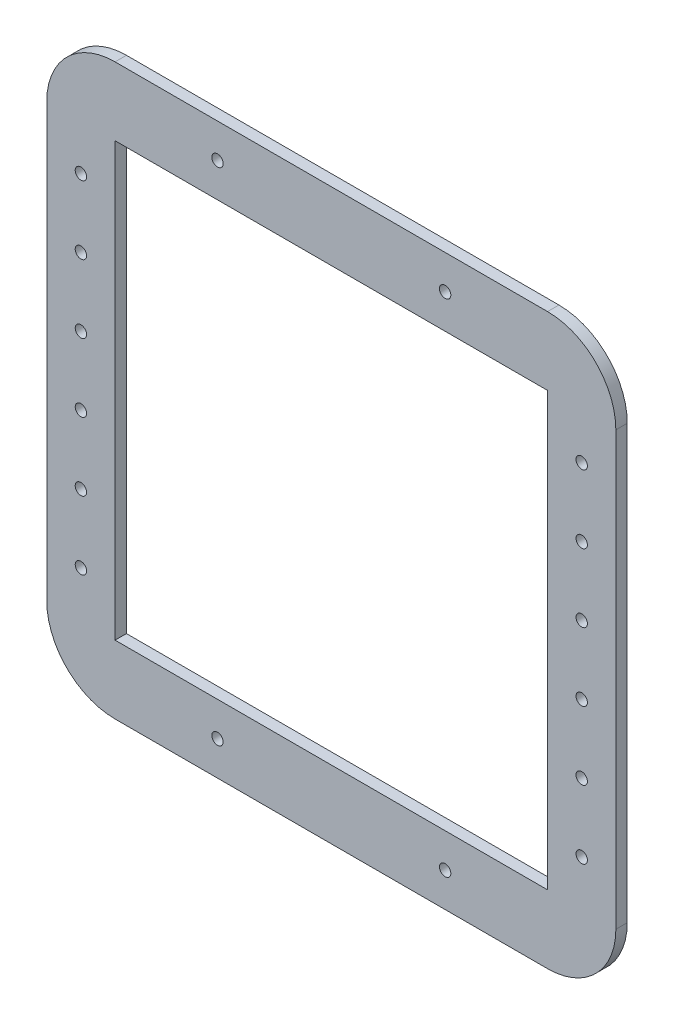
ISO-10303-21;
HEADER;
FILE_DESCRIPTION(('STEP AP214'),'2;1');
FILE_NAME('part.step','',(''),(''),'','','');
FILE_SCHEMA(('AUTOMOTIVE_DESIGN { 1 0 10303 214 1 1 1 1 }'));
ENDSEC;
DATA;
#1=APPLICATION_CONTEXT('core data for automotive mechanical design processes');
#2=APPLICATION_PROTOCOL_DEFINITION('international standard','automotive_design',2000,#1);
#3=PRODUCT_CONTEXT('',#1,'mechanical');
#4=PRODUCT('Part','Part','',(#3));
#5=PRODUCT_RELATED_PRODUCT_CATEGORY('part','',(#4));
#6=PRODUCT_DEFINITION_FORMATION('','',#4);
#7=PRODUCT_DEFINITION_CONTEXT('part definition',#1,'design');
#8=PRODUCT_DEFINITION('design','',#6,#7);
#9=PRODUCT_DEFINITION_SHAPE('','',#8);
#10=(LENGTH_UNIT() NAMED_UNIT(*) SI_UNIT(.MILLI.,.METRE.));
#11=(NAMED_UNIT(*) PLANE_ANGLE_UNIT() SI_UNIT($,.RADIAN.));
#12=(NAMED_UNIT(*) SI_UNIT($,.STERADIAN.) SOLID_ANGLE_UNIT());
#13=UNCERTAINTY_MEASURE_WITH_UNIT(LENGTH_MEASURE(1.E-05),#10,'distance_accuracy_value','');
#14=(GEOMETRIC_REPRESENTATION_CONTEXT(3) GLOBAL_UNCERTAINTY_ASSIGNED_CONTEXT((#13)) GLOBAL_UNIT_ASSIGNED_CONTEXT((#10,
#11,#12)) REPRESENTATION_CONTEXT('',''));
#15=CARTESIAN_POINT('',(0.,0.,0.));
#16=DIRECTION('',(0.,0.,1.));
#17=DIRECTION('',(1.,0.,0.));
#18=AXIS2_PLACEMENT_3D('',#15,#16,#17);
#19=CARTESIAN_POINT('',(110.,-75.,0.));
#20=DIRECTION('',(0.,0.,1.));
#21=DIRECTION('',(1.,0.,0.));
#22=AXIS2_PLACEMENT_3D('',#19,#20,#21);
#23=CYLINDRICAL_SURFACE('',#22,2.5);
#24=CARTESIAN_POINT('',(110.,-75.,0.));
#25=DIRECTION('',(0.,0.,1.));
#26=DIRECTION('',(1.,0.,0.));
#27=AXIS2_PLACEMENT_3D('',#24,#25,#26);
#28=CIRCLE('',#27,2.5);
#29=CARTESIAN_POINT('',(112.5,-75.,0.));
#30=VERTEX_POINT('',#29);
#31=EDGE_CURVE('E46',#30,#30,#28,.T.);
#32=ORIENTED_EDGE('',*,*,#31,.F.);
#33=EDGE_LOOP('',(#32));
#34=FACE_BOUND('',#33,.T.);
#35=CARTESIAN_POINT('',(110.,-75.,5.));
#36=DIRECTION('',(0.,0.,1.));
#37=DIRECTION('',(1.,0.,0.));
#38=AXIS2_PLACEMENT_3D('',#35,#36,#37);
#39=CIRCLE('',#38,2.5);
#40=CARTESIAN_POINT('',(112.5,-75.,5.));
#41=VERTEX_POINT('',#40);
#42=EDGE_CURVE('E11',#41,#41,#39,.T.);
#43=ORIENTED_EDGE('',*,*,#42,.T.);
#44=EDGE_LOOP('',(#43));
#45=FACE_BOUND('',#44,.T.);
#46=ADVANCED_FACE('F39',(#34,#45),#23,.F.);
#47=CARTESIAN_POINT('',(110.,-45.,0.));
#48=DIRECTION('',(0.,0.,1.));
#49=DIRECTION('',(1.,0.,0.));
#50=AXIS2_PLACEMENT_3D('',#47,#48,#49);
#51=CYLINDRICAL_SURFACE('',#50,2.5);
#52=CARTESIAN_POINT('',(110.,-45.,0.));
#53=DIRECTION('',(0.,0.,1.));
#54=DIRECTION('',(1.,0.,0.));
#55=AXIS2_PLACEMENT_3D('',#52,#53,#54);
#56=CIRCLE('',#55,2.5);
#57=CARTESIAN_POINT('',(112.5,-45.,0.));
#58=VERTEX_POINT('',#57);
#59=EDGE_CURVE('E260',#58,#58,#56,.T.);
#60=ORIENTED_EDGE('',*,*,#59,.F.);
#61=EDGE_LOOP('',(#60));
#62=FACE_BOUND('',#61,.T.);
#63=CARTESIAN_POINT('',(110.,-45.,5.));
#64=DIRECTION('',(0.,0.,1.));
#65=DIRECTION('',(1.,0.,0.));
#66=AXIS2_PLACEMENT_3D('',#63,#64,#65);
#67=CIRCLE('',#66,2.5);
#68=CARTESIAN_POINT('',(112.5,-45.,5.));
#69=VERTEX_POINT('',#68);
#70=EDGE_CURVE('E263',#69,#69,#67,.T.);
#71=ORIENTED_EDGE('',*,*,#70,.T.);
#72=EDGE_LOOP('',(#71));
#73=FACE_BOUND('',#72,.T.);
#74=ADVANCED_FACE('F272',(#62,#73),#51,.F.);
#75=CARTESIAN_POINT('',(110.,-15.,0.));
#76=DIRECTION('',(0.,0.,1.));
#77=DIRECTION('',(1.,0.,0.));
#78=AXIS2_PLACEMENT_3D('',#75,#76,#77);
#79=CYLINDRICAL_SURFACE('',#78,2.5);
#80=CARTESIAN_POINT('',(110.,-15.,0.));
#81=DIRECTION('',(0.,0.,1.));
#82=DIRECTION('',(1.,0.,0.));
#83=AXIS2_PLACEMENT_3D('',#80,#81,#82);
#84=CIRCLE('',#83,2.5);
#85=CARTESIAN_POINT('',(112.5,-15.,0.));
#86=VERTEX_POINT('',#85);
#87=EDGE_CURVE('E254',#86,#86,#84,.T.);
#88=ORIENTED_EDGE('',*,*,#87,.F.);
#89=EDGE_LOOP('',(#88));
#90=FACE_BOUND('',#89,.T.);
#91=CARTESIAN_POINT('',(110.,-15.,5.));
#92=DIRECTION('',(0.,0.,1.));
#93=DIRECTION('',(1.,0.,0.));
#94=AXIS2_PLACEMENT_3D('',#91,#92,#93);
#95=CIRCLE('',#94,2.5);
#96=CARTESIAN_POINT('',(112.5,-15.,5.));
#97=VERTEX_POINT('',#96);
#98=EDGE_CURVE('E257',#97,#97,#95,.T.);
#99=ORIENTED_EDGE('',*,*,#98,.T.);
#100=EDGE_LOOP('',(#99));
#101=FACE_BOUND('',#100,.T.);
#102=ADVANCED_FACE('F339',(#90,#101),#79,.F.);
#103=CARTESIAN_POINT('',(110.,15.,0.));
#104=DIRECTION('',(0.,0.,1.));
#105=DIRECTION('',(1.,0.,0.));
#106=AXIS2_PLACEMENT_3D('',#103,#104,#105);
#107=CYLINDRICAL_SURFACE('',#106,2.5);
#108=CARTESIAN_POINT('',(110.,15.,0.));
#109=DIRECTION('',(0.,0.,1.));
#110=DIRECTION('',(1.,0.,0.));
#111=AXIS2_PLACEMENT_3D('',#108,#109,#110);
#112=CIRCLE('',#111,2.5);
#113=CARTESIAN_POINT('',(112.5,15.,0.));
#114=VERTEX_POINT('',#113);
#115=EDGE_CURVE('E248',#114,#114,#112,.T.);
#116=ORIENTED_EDGE('',*,*,#115,.F.);
#117=EDGE_LOOP('',(#116));
#118=FACE_BOUND('',#117,.T.);
#119=CARTESIAN_POINT('',(110.,15.,5.));
#120=DIRECTION('',(0.,0.,1.));
#121=DIRECTION('',(1.,0.,0.));
#122=AXIS2_PLACEMENT_3D('',#119,#120,#121);
#123=CIRCLE('',#122,2.5);
#124=CARTESIAN_POINT('',(112.5,15.,5.));
#125=VERTEX_POINT('',#124);
#126=EDGE_CURVE('E251',#125,#125,#123,.T.);
#127=ORIENTED_EDGE('',*,*,#126,.T.);
#128=EDGE_LOOP('',(#127));
#129=FACE_BOUND('',#128,.T.);
#130=ADVANCED_FACE('F335',(#118,#129),#107,.F.);
#131=CARTESIAN_POINT('',(-110.,-75.,0.));
#132=DIRECTION('',(0.,0.,1.));
#133=DIRECTION('',(1.,0.,0.));
#134=AXIS2_PLACEMENT_3D('',#131,#132,#133);
#135=CYLINDRICAL_SURFACE('',#134,2.5);
#136=CARTESIAN_POINT('',(-110.,-75.,0.));
#137=DIRECTION('',(0.,0.,1.));
#138=DIRECTION('',(1.,0.,0.));
#139=AXIS2_PLACEMENT_3D('',#136,#137,#138);
#140=CIRCLE('',#139,2.5);
#141=CARTESIAN_POINT('',(-107.5,-75.,0.));
#142=VERTEX_POINT('',#141);
#143=EDGE_CURVE('E242',#142,#142,#140,.T.);
#144=ORIENTED_EDGE('',*,*,#143,.F.);
#145=EDGE_LOOP('',(#144));
#146=FACE_BOUND('',#145,.T.);
#147=CARTESIAN_POINT('',(-110.,-75.,5.));
#148=DIRECTION('',(0.,0.,1.));
#149=DIRECTION('',(1.,0.,0.));
#150=AXIS2_PLACEMENT_3D('',#147,#148,#149);
#151=CIRCLE('',#150,2.5);
#152=CARTESIAN_POINT('',(-107.5,-75.,5.));
#153=VERTEX_POINT('',#152);
#154=EDGE_CURVE('E245',#153,#153,#151,.T.);
#155=ORIENTED_EDGE('',*,*,#154,.T.);
#156=EDGE_LOOP('',(#155));
#157=FACE_BOUND('',#156,.T.);
#158=ADVANCED_FACE('F331',(#146,#157),#135,.F.);
#159=CARTESIAN_POINT('',(-110.,-45.,0.));
#160=DIRECTION('',(0.,0.,1.));
#161=DIRECTION('',(1.,0.,0.));
#162=AXIS2_PLACEMENT_3D('',#159,#160,#161);
#163=CYLINDRICAL_SURFACE('',#162,2.5);
#164=CARTESIAN_POINT('',(-110.,-45.,0.));
#165=DIRECTION('',(0.,0.,1.));
#166=DIRECTION('',(1.,0.,0.));
#167=AXIS2_PLACEMENT_3D('',#164,#165,#166);
#168=CIRCLE('',#167,2.5);
#169=CARTESIAN_POINT('',(-107.5,-45.,0.));
#170=VERTEX_POINT('',#169);
#171=EDGE_CURVE('E236',#170,#170,#168,.T.);
#172=ORIENTED_EDGE('',*,*,#171,.F.);
#173=EDGE_LOOP('',(#172));
#174=FACE_BOUND('',#173,.T.);
#175=CARTESIAN_POINT('',(-110.,-45.,5.));
#176=DIRECTION('',(0.,0.,1.));
#177=DIRECTION('',(1.,0.,0.));
#178=AXIS2_PLACEMENT_3D('',#175,#176,#177);
#179=CIRCLE('',#178,2.5);
#180=CARTESIAN_POINT('',(-107.5,-45.,5.));
#181=VERTEX_POINT('',#180);
#182=EDGE_CURVE('E239',#181,#181,#179,.T.);
#183=ORIENTED_EDGE('',*,*,#182,.T.);
#184=EDGE_LOOP('',(#183));
#185=FACE_BOUND('',#184,.T.);
#186=ADVANCED_FACE('F327',(#174,#185),#163,.F.);
#187=CARTESIAN_POINT('',(-110.,-15.,0.));
#188=DIRECTION('',(0.,0.,1.));
#189=DIRECTION('',(1.,0.,0.));
#190=AXIS2_PLACEMENT_3D('',#187,#188,#189);
#191=CYLINDRICAL_SURFACE('',#190,2.5);
#192=CARTESIAN_POINT('',(-110.,-15.,0.));
#193=DIRECTION('',(0.,0.,1.));
#194=DIRECTION('',(1.,0.,0.));
#195=AXIS2_PLACEMENT_3D('',#192,#193,#194);
#196=CIRCLE('',#195,2.5);
#197=CARTESIAN_POINT('',(-107.5,-15.,0.));
#198=VERTEX_POINT('',#197);
#199=EDGE_CURVE('E230',#198,#198,#196,.T.);
#200=ORIENTED_EDGE('',*,*,#199,.F.);
#201=EDGE_LOOP('',(#200));
#202=FACE_BOUND('',#201,.T.);
#203=CARTESIAN_POINT('',(-110.,-15.,5.));
#204=DIRECTION('',(0.,0.,1.));
#205=DIRECTION('',(1.,0.,0.));
#206=AXIS2_PLACEMENT_3D('',#203,#204,#205);
#207=CIRCLE('',#206,2.5);
#208=CARTESIAN_POINT('',(-107.5,-15.,5.));
#209=VERTEX_POINT('',#208);
#210=EDGE_CURVE('E233',#209,#209,#207,.T.);
#211=ORIENTED_EDGE('',*,*,#210,.T.);
#212=EDGE_LOOP('',(#211));
#213=FACE_BOUND('',#212,.T.);
#214=ADVANCED_FACE('F286',(#202,#213),#191,.F.);
#215=CARTESIAN_POINT('',(-110.,15.,0.));
#216=DIRECTION('',(0.,0.,1.));
#217=DIRECTION('',(1.,0.,0.));
#218=AXIS2_PLACEMENT_3D('',#215,#216,#217);
#219=CYLINDRICAL_SURFACE('',#218,2.5);
#220=CARTESIAN_POINT('',(-110.,15.,0.));
#221=DIRECTION('',(0.,0.,1.));
#222=DIRECTION('',(1.,0.,0.));
#223=AXIS2_PLACEMENT_3D('',#220,#221,#222);
#224=CIRCLE('',#223,2.5);
#225=CARTESIAN_POINT('',(-107.5,15.,0.));
#226=VERTEX_POINT('',#225);
#227=EDGE_CURVE('E224',#226,#226,#224,.T.);
#228=ORIENTED_EDGE('',*,*,#227,.F.);
#229=EDGE_LOOP('',(#228));
#230=FACE_BOUND('',#229,.T.);
#231=CARTESIAN_POINT('',(-110.,15.,5.));
#232=DIRECTION('',(0.,0.,1.));
#233=DIRECTION('',(1.,0.,0.));
#234=AXIS2_PLACEMENT_3D('',#231,#232,#233);
#235=CIRCLE('',#234,2.5);
#236=CARTESIAN_POINT('',(-107.5,15.,5.));
#237=VERTEX_POINT('',#236);
#238=EDGE_CURVE('E227',#237,#237,#235,.T.);
#239=ORIENTED_EDGE('',*,*,#238,.T.);
#240=EDGE_LOOP('',(#239));
#241=FACE_BOUND('',#240,.T.);
#242=ADVANCED_FACE('F276',(#230,#241),#219,.F.);
#243=CARTESIAN_POINT('',(-95.,-95.,5.));
#244=DIRECTION('',(0.,0.,1.));
#245=DIRECTION('',(1.,0.,0.));
#246=AXIS2_PLACEMENT_3D('',#243,#244,#245);
#247=PLANE('',#246);
#248=CARTESIAN_POINT('',(50.0000000000001,110.,5.));
#249=DIRECTION('',(0.,0.,1.));
#250=DIRECTION('',(-1.,0.,0.));
#251=AXIS2_PLACEMENT_3D('',#248,#249,#250);
#252=CIRCLE('',#251,2.5);
#253=CARTESIAN_POINT('',(47.5000000000001,110.,5.));
#254=VERTEX_POINT('',#253);
#255=EDGE_CURVE('E692',#254,#254,#252,.T.);
#256=ORIENTED_EDGE('',*,*,#255,.F.);
#257=EDGE_LOOP('',(#256));
#258=FACE_BOUND('',#257,.T.);
#259=CARTESIAN_POINT('',(-49.9999999999999,-110.,5.));
#260=DIRECTION('',(0.,0.,1.));
#261=DIRECTION('',(-1.,0.,0.));
#262=AXIS2_PLACEMENT_3D('',#259,#260,#261);
#263=CIRCLE('',#262,2.5);
#264=CARTESIAN_POINT('',(-52.4999999999999,-110.,5.));
#265=VERTEX_POINT('',#264);
#266=EDGE_CURVE('E698',#265,#265,#263,.T.);
#267=ORIENTED_EDGE('',*,*,#266,.F.);
#268=EDGE_LOOP('',(#267));
#269=FACE_BOUND('',#268,.T.);
#270=CARTESIAN_POINT('',(50.0000000000002,-110.,5.));
#271=DIRECTION('',(0.,0.,1.));
#272=DIRECTION('',(1.,0.,0.));
#273=AXIS2_PLACEMENT_3D('',#270,#271,#272);
#274=CIRCLE('',#273,2.5);
#275=CARTESIAN_POINT('',(52.5000000000002,-110.,5.));
#276=VERTEX_POINT('',#275);
#277=EDGE_CURVE('E699',#276,#276,#274,.T.);
#278=ORIENTED_EDGE('',*,*,#277,.F.);
#279=EDGE_LOOP('',(#278));
#280=FACE_BOUND('',#279,.T.);
#281=CARTESIAN_POINT('',(-50.,110.,5.));
#282=DIRECTION('',(0.,0.,1.));
#283=DIRECTION('',(1.,0.,0.));
#284=AXIS2_PLACEMENT_3D('',#281,#282,#283);
#285=CIRCLE('',#284,2.5);
#286=CARTESIAN_POINT('',(-47.5,110.,5.));
#287=VERTEX_POINT('',#286);
#288=EDGE_CURVE('E689',#287,#287,#285,.T.);
#289=ORIENTED_EDGE('',*,*,#288,.F.);
#290=EDGE_LOOP('',(#289));
#291=FACE_BOUND('',#290,.T.);
#292=CARTESIAN_POINT('',(110.,45.,5.));
#293=DIRECTION('',(0.,0.,1.));
#294=DIRECTION('',(1.,0.,0.));
#295=AXIS2_PLACEMENT_3D('',#292,#293,#294);
#296=CIRCLE('',#295,2.5);
#297=CARTESIAN_POINT('',(112.5,45.,5.));
#298=VERTEX_POINT('',#297);
#299=EDGE_CURVE('E682',#298,#298,#296,.T.);
#300=ORIENTED_EDGE('',*,*,#299,.F.);
#301=EDGE_LOOP('',(#300));
#302=FACE_BOUND('',#301,.T.);
#303=CARTESIAN_POINT('',(-110.,45.,5.));
#304=DIRECTION('',(0.,0.,1.));
#305=DIRECTION('',(1.,0.,0.));
#306=AXIS2_PLACEMENT_3D('',#303,#304,#305);
#307=CIRCLE('',#306,2.5);
#308=CARTESIAN_POINT('',(-107.5,45.,5.));
#309=VERTEX_POINT('',#308);
#310=EDGE_CURVE('E673',#309,#309,#307,.T.);
#311=ORIENTED_EDGE('',*,*,#310,.F.);
#312=EDGE_LOOP('',(#311));
#313=FACE_BOUND('',#312,.T.);
#314=CARTESIAN_POINT('',(-110.,75.,5.));
#315=DIRECTION('',(0.,0.,1.));
#316=DIRECTION('',(1.,0.,0.));
#317=AXIS2_PLACEMENT_3D('',#314,#315,#316);
#318=CIRCLE('',#317,2.5);
#319=CARTESIAN_POINT('',(-107.5,75.,5.));
#320=VERTEX_POINT('',#319);
#321=EDGE_CURVE('E669',#320,#320,#318,.T.);
#322=ORIENTED_EDGE('',*,*,#321,.F.);
#323=EDGE_LOOP('',(#322));
#324=FACE_BOUND('',#323,.T.);
#325=CARTESIAN_POINT('',(110.,75.,5.));
#326=DIRECTION('',(0.,0.,1.));
#327=DIRECTION('',(1.,0.,0.));
#328=AXIS2_PLACEMENT_3D('',#325,#326,#327);
#329=CIRCLE('',#328,2.5);
#330=CARTESIAN_POINT('',(112.5,75.,5.));
#331=VERTEX_POINT('',#330);
#332=EDGE_CURVE('E667',#331,#331,#329,.T.);
#333=ORIENTED_EDGE('',*,*,#332,.F.);
#334=EDGE_LOOP('',(#333));
#335=FACE_BOUND('',#334,.T.);
#336=CARTESIAN_POINT('',(-95.,-95.,5.));
#337=DIRECTION('',(0.,0.,1.));
#338=DIRECTION('',(1.,0.,0.));
#339=AXIS2_PLACEMENT_3D('',#336,#337,#338);
#340=CIRCLE('',#339,30.);
#341=CARTESIAN_POINT('',(-125.,-95.,5.));
#342=VERTEX_POINT('',#341);
#343=CARTESIAN_POINT('',(-95.,-125.,5.));
#344=VERTEX_POINT('',#343);
#345=EDGE_CURVE('E167',#342,#344,#340,.T.);
#346=ORIENTED_EDGE('',*,*,#345,.T.);
#347=DIRECTION('',(1.,0.,0.));
#348=VECTOR('',#347,1.);
#349=CARTESIAN_POINT('',(-95.,-125.,5.));
#350=LINE('',#349,#348);
#351=CARTESIAN_POINT('',(95.,-125.,5.));
#352=VERTEX_POINT('',#351);
#353=EDGE_CURVE('E170',#344,#352,#350,.T.);
#354=ORIENTED_EDGE('',*,*,#353,.T.);
#355=CARTESIAN_POINT('',(95.,-95.,5.));
#356=DIRECTION('',(0.,0.,1.));
#357=DIRECTION('',(1.,0.,0.));
#358=AXIS2_PLACEMENT_3D('',#355,#356,#357);
#359=CIRCLE('',#358,30.);
#360=CARTESIAN_POINT('',(125.,-95.,5.));
#361=VERTEX_POINT('',#360);
#362=EDGE_CURVE('E173',#352,#361,#359,.T.);
#363=ORIENTED_EDGE('',*,*,#362,.T.);
#364=DIRECTION('',(0.,1.,0.));
#365=VECTOR('',#364,1.);
#366=CARTESIAN_POINT('',(125.,95.,5.));
#367=LINE('',#366,#365);
#368=CARTESIAN_POINT('',(125.,95.,5.));
#369=VERTEX_POINT('',#368);
#370=EDGE_CURVE('E175',#361,#369,#367,.T.);
#371=ORIENTED_EDGE('',*,*,#370,.T.);
#372=CARTESIAN_POINT('',(95.,95.,5.));
#373=DIRECTION('',(0.,0.,1.));
#374=DIRECTION('',(-1.,0.,0.));
#375=AXIS2_PLACEMENT_3D('',#372,#373,#374);
#376=CIRCLE('',#375,30.);
#377=CARTESIAN_POINT('',(95.,125.,5.));
#378=VERTEX_POINT('',#377);
#379=EDGE_CURVE('E177',#369,#378,#376,.T.);
#380=ORIENTED_EDGE('',*,*,#379,.T.);
#381=DIRECTION('',(-1.,0.,0.));
#382=VECTOR('',#381,1.);
#383=CARTESIAN_POINT('',(-95.,125.,5.));
#384=LINE('',#383,#382);
#385=CARTESIAN_POINT('',(-95.,125.,5.));
#386=VERTEX_POINT('',#385);
#387=EDGE_CURVE('E179',#378,#386,#384,.T.);
#388=ORIENTED_EDGE('',*,*,#387,.T.);
#389=CARTESIAN_POINT('',(-95.,95.,5.));
#390=DIRECTION('',(0.,0.,1.));
#391=DIRECTION('',(1.,0.,0.));
#392=AXIS2_PLACEMENT_3D('',#389,#390,#391);
#393=CIRCLE('',#392,30.);
#394=CARTESIAN_POINT('',(-125.,95.,5.));
#395=VERTEX_POINT('',#394);
#396=EDGE_CURVE('E181',#386,#395,#393,.T.);
#397=ORIENTED_EDGE('',*,*,#396,.T.);
#398=DIRECTION('',(0.,-1.,0.));
#399=VECTOR('',#398,1.);
#400=CARTESIAN_POINT('',(-125.,95.,5.));
#401=LINE('',#400,#399);
#402=EDGE_CURVE('E183',#395,#342,#401,.T.);
#403=ORIENTED_EDGE('',*,*,#402,.T.);
#404=EDGE_LOOP('',(#346,#354,#363,#371,#380,#388,#397,#403));
#405=FACE_BOUND('',#404,.T.);
#406=DIRECTION('',(0.,-1.,0.));
#407=VECTOR('',#406,1.);
#408=CARTESIAN_POINT('',(-95.,95.,5.));
#409=LINE('',#408,#407);
#410=CARTESIAN_POINT('',(-95.,95.,5.));
#411=VERTEX_POINT('',#410);
#412=CARTESIAN_POINT('',(-94.9999999999999,-95.,5.));
#413=VERTEX_POINT('',#412);
#414=EDGE_CURVE('E135',#411,#413,#409,.T.);
#415=ORIENTED_EDGE('',*,*,#414,.F.);
#416=DIRECTION('',(-1.,0.,0.));
#417=VECTOR('',#416,1.);
#418=CARTESIAN_POINT('',(-95.,95.,5.));
#419=LINE('',#418,#417);
#420=CARTESIAN_POINT('',(95.,95.,5.));
#421=VERTEX_POINT('',#420);
#422=EDGE_CURVE('E127',#421,#411,#419,.T.);
#423=ORIENTED_EDGE('',*,*,#422,.F.);
#424=DIRECTION('',(0.,1.,0.));
#425=VECTOR('',#424,1.);
#426=CARTESIAN_POINT('',(95.,95.,5.));
#427=LINE('',#426,#425);
#428=CARTESIAN_POINT('',(95.,-95.,5.));
#429=VERTEX_POINT('',#428);
#430=EDGE_CURVE('E151',#429,#421,#427,.T.);
#431=ORIENTED_EDGE('',*,*,#430,.F.);
#432=DIRECTION('',(1.,0.,0.));
#433=VECTOR('',#432,1.);
#434=CARTESIAN_POINT('',(-94.9999999999999,-95.,5.));
#435=LINE('',#434,#433);
#436=EDGE_CURVE('E149',#413,#429,#435,.T.);
#437=ORIENTED_EDGE('',*,*,#436,.F.);
#438=EDGE_LOOP('',(#415,#423,#431,#437));
#439=FACE_BOUND('',#438,.T.);
#440=ORIENTED_EDGE('',*,*,#238,.F.);
#441=EDGE_LOOP('',(#440));
#442=FACE_BOUND('',#441,.T.);
#443=ORIENTED_EDGE('',*,*,#210,.F.);
#444=EDGE_LOOP('',(#443));
#445=FACE_BOUND('',#444,.T.);
#446=ORIENTED_EDGE('',*,*,#182,.F.);
#447=EDGE_LOOP('',(#446));
#448=FACE_BOUND('',#447,.T.);
#449=ORIENTED_EDGE('',*,*,#154,.F.);
#450=EDGE_LOOP('',(#449));
#451=FACE_BOUND('',#450,.T.);
#452=ORIENTED_EDGE('',*,*,#126,.F.);
#453=EDGE_LOOP('',(#452));
#454=FACE_BOUND('',#453,.T.);
#455=ORIENTED_EDGE('',*,*,#98,.F.);
#456=EDGE_LOOP('',(#455));
#457=FACE_BOUND('',#456,.T.);
#458=ORIENTED_EDGE('',*,*,#70,.F.);
#459=EDGE_LOOP('',(#458));
#460=FACE_BOUND('',#459,.T.);
#461=ORIENTED_EDGE('',*,*,#42,.F.);
#462=EDGE_LOOP('',(#461));
#463=FACE_BOUND('',#462,.T.);
#464=ADVANCED_FACE('F147',(#258,#269,#280,#291,#302,#313,#324,#335,#405,#439,#442,#445,#448,
#451,#454,#457,#460,#463),#247,.T.);
#465=CARTESIAN_POINT('',(-95.,-95.,0.));
#466=DIRECTION('',(0.,0.,1.));
#467=DIRECTION('',(1.,0.,0.));
#468=AXIS2_PLACEMENT_3D('',#465,#466,#467);
#469=PLANE('',#468);
#470=CARTESIAN_POINT('',(50.0000000000001,110.,0.));
#471=DIRECTION('',(0.,0.,1.));
#472=DIRECTION('',(-1.,0.,0.));
#473=AXIS2_PLACEMENT_3D('',#470,#471,#472);
#474=CIRCLE('',#473,2.5);
#475=CARTESIAN_POINT('',(47.5000000000001,110.,0.));
#476=VERTEX_POINT('',#475);
#477=EDGE_CURVE('E702',#476,#476,#474,.T.);
#478=ORIENTED_EDGE('',*,*,#477,.T.);
#479=EDGE_LOOP('',(#478));
#480=FACE_BOUND('',#479,.T.);
#481=CARTESIAN_POINT('',(-49.9999999999999,-110.,0.));
#482=DIRECTION('',(0.,0.,1.));
#483=DIRECTION('',(-1.,0.,0.));
#484=AXIS2_PLACEMENT_3D('',#481,#482,#483);
#485=CIRCLE('',#484,2.5);
#486=CARTESIAN_POINT('',(-52.4999999999999,-110.,0.));
#487=VERTEX_POINT('',#486);
#488=EDGE_CURVE('E695',#487,#487,#485,.T.);
#489=ORIENTED_EDGE('',*,*,#488,.T.);
#490=EDGE_LOOP('',(#489));
#491=FACE_BOUND('',#490,.T.);
#492=CARTESIAN_POINT('',(50.0000000000002,-110.,0.));
#493=DIRECTION('',(0.,0.,1.));
#494=DIRECTION('',(1.,0.,0.));
#495=AXIS2_PLACEMENT_3D('',#492,#493,#494);
#496=CIRCLE('',#495,2.5);
#497=CARTESIAN_POINT('',(52.5000000000002,-110.,0.));
#498=VERTEX_POINT('',#497);
#499=EDGE_CURVE('E707',#498,#498,#496,.T.);
#500=ORIENTED_EDGE('',*,*,#499,.T.);
#501=EDGE_LOOP('',(#500));
#502=FACE_BOUND('',#501,.T.);
#503=CARTESIAN_POINT('',(-50.,110.,0.));
#504=DIRECTION('',(0.,0.,1.));
#505=DIRECTION('',(1.,0.,0.));
#506=AXIS2_PLACEMENT_3D('',#503,#504,#505);
#507=CIRCLE('',#506,2.5);
#508=CARTESIAN_POINT('',(-47.5,110.,0.));
#509=VERTEX_POINT('',#508);
#510=EDGE_CURVE('E688',#509,#509,#507,.T.);
#511=ORIENTED_EDGE('',*,*,#510,.T.);
#512=EDGE_LOOP('',(#511));
#513=FACE_BOUND('',#512,.T.);
#514=CARTESIAN_POINT('',(110.,45.,0.));
#515=DIRECTION('',(0.,0.,1.));
#516=DIRECTION('',(1.,0.,0.));
#517=AXIS2_PLACEMENT_3D('',#514,#515,#516);
#518=CIRCLE('',#517,2.5);
#519=CARTESIAN_POINT('',(112.5,45.,0.));
#520=VERTEX_POINT('',#519);
#521=EDGE_CURVE('E685',#520,#520,#518,.T.);
#522=ORIENTED_EDGE('',*,*,#521,.T.);
#523=EDGE_LOOP('',(#522));
#524=FACE_BOUND('',#523,.T.);
#525=CARTESIAN_POINT('',(-110.,45.,0.));
#526=DIRECTION('',(0.,0.,1.));
#527=DIRECTION('',(1.,0.,0.));
#528=AXIS2_PLACEMENT_3D('',#525,#526,#527);
#529=CIRCLE('',#528,2.5);
#530=CARTESIAN_POINT('',(-107.5,45.,0.));
#531=VERTEX_POINT('',#530);
#532=EDGE_CURVE('E679',#531,#531,#529,.T.);
#533=ORIENTED_EDGE('',*,*,#532,.T.);
#534=EDGE_LOOP('',(#533));
#535=FACE_BOUND('',#534,.T.);
#536=CARTESIAN_POINT('',(-110.,75.,0.));
#537=DIRECTION('',(0.,0.,1.));
#538=DIRECTION('',(1.,0.,0.));
#539=AXIS2_PLACEMENT_3D('',#536,#537,#538);
#540=CIRCLE('',#539,2.5);
#541=CARTESIAN_POINT('',(-107.5,75.,0.));
#542=VERTEX_POINT('',#541);
#543=EDGE_CURVE('E157',#542,#542,#540,.T.);
#544=ORIENTED_EDGE('',*,*,#543,.T.);
#545=EDGE_LOOP('',(#544));
#546=FACE_BOUND('',#545,.T.);
#547=CARTESIAN_POINT('',(110.,75.,0.));
#548=DIRECTION('',(0.,0.,1.));
#549=DIRECTION('',(1.,0.,0.));
#550=AXIS2_PLACEMENT_3D('',#547,#548,#549);
#551=CIRCLE('',#550,2.5);
#552=CARTESIAN_POINT('',(112.5,75.,0.));
#553=VERTEX_POINT('',#552);
#554=EDGE_CURVE('E664',#553,#553,#551,.T.);
#555=ORIENTED_EDGE('',*,*,#554,.T.);
#556=EDGE_LOOP('',(#555));
#557=FACE_BOUND('',#556,.T.);
#558=CARTESIAN_POINT('',(-95.,-95.,0.));
#559=DIRECTION('',(0.,0.,1.));
#560=DIRECTION('',(1.,0.,0.));
#561=AXIS2_PLACEMENT_3D('',#558,#559,#560);
#562=CIRCLE('',#561,30.);
#563=CARTESIAN_POINT('',(-125.,-95.,0.));
#564=VERTEX_POINT('',#563);
#565=CARTESIAN_POINT('',(-95.,-125.,0.));
#566=VERTEX_POINT('',#565);
#567=EDGE_CURVE('E143',#564,#566,#562,.T.);
#568=ORIENTED_EDGE('',*,*,#567,.F.);
#569=DIRECTION('',(0.,-1.,0.));
#570=VECTOR('',#569,1.);
#571=CARTESIAN_POINT('',(-125.,95.,0.));
#572=LINE('',#571,#570);
#573=CARTESIAN_POINT('',(-125.,95.,0.));
#574=VERTEX_POINT('',#573);
#575=EDGE_CURVE('E171',#574,#564,#572,.T.);
#576=ORIENTED_EDGE('',*,*,#575,.F.);
#577=CARTESIAN_POINT('',(-95.,95.,0.));
#578=DIRECTION('',(0.,0.,1.));
#579=DIRECTION('',(1.,0.,0.));
#580=AXIS2_PLACEMENT_3D('',#577,#578,#579);
#581=CIRCLE('',#580,30.);
#582=CARTESIAN_POINT('',(-95.,125.,0.));
#583=VERTEX_POINT('',#582);
#584=EDGE_CURVE('E198',#583,#574,#581,.T.);
#585=ORIENTED_EDGE('',*,*,#584,.F.);
#586=DIRECTION('',(-1.,0.,0.));
#587=VECTOR('',#586,1.);
#588=CARTESIAN_POINT('',(-95.,125.,0.));
#589=LINE('',#588,#587);
#590=CARTESIAN_POINT('',(95.,125.,0.));
#591=VERTEX_POINT('',#590);
#592=EDGE_CURVE('E196',#591,#583,#589,.T.);
#593=ORIENTED_EDGE('',*,*,#592,.F.);
#594=CARTESIAN_POINT('',(95.,95.,0.));
#595=DIRECTION('',(0.,0.,1.));
#596=DIRECTION('',(-1.,0.,0.));
#597=AXIS2_PLACEMENT_3D('',#594,#595,#596);
#598=CIRCLE('',#597,30.);
#599=CARTESIAN_POINT('',(125.,95.,0.));
#600=VERTEX_POINT('',#599);
#601=EDGE_CURVE('E194',#600,#591,#598,.T.);
#602=ORIENTED_EDGE('',*,*,#601,.F.);
#603=DIRECTION('',(0.,1.,0.));
#604=VECTOR('',#603,1.);
#605=CARTESIAN_POINT('',(125.,95.,0.));
#606=LINE('',#605,#604);
#607=CARTESIAN_POINT('',(125.,-95.,0.));
#608=VERTEX_POINT('',#607);
#609=EDGE_CURVE('E192',#608,#600,#606,.T.);
#610=ORIENTED_EDGE('',*,*,#609,.F.);
#611=CARTESIAN_POINT('',(95.,-95.,0.));
#612=DIRECTION('',(0.,0.,1.));
#613=DIRECTION('',(1.,0.,0.));
#614=AXIS2_PLACEMENT_3D('',#611,#612,#613);
#615=CIRCLE('',#614,30.);
#616=CARTESIAN_POINT('',(95.,-125.,0.));
#617=VERTEX_POINT('',#616);
#618=EDGE_CURVE('E190',#617,#608,#615,.T.);
#619=ORIENTED_EDGE('',*,*,#618,.F.);
#620=DIRECTION('',(1.,0.,0.));
#621=VECTOR('',#620,1.);
#622=CARTESIAN_POINT('',(-95.,-125.,0.));
#623=LINE('',#622,#621);
#624=EDGE_CURVE('E188',#566,#617,#623,.T.);
#625=ORIENTED_EDGE('',*,*,#624,.F.);
#626=EDGE_LOOP('',(#568,#576,#585,#593,#602,#610,#619,#625));
#627=FACE_BOUND('',#626,.T.);
#628=DIRECTION('',(-1.,0.,0.));
#629=VECTOR('',#628,1.);
#630=CARTESIAN_POINT('',(-95.,95.,0.));
#631=LINE('',#630,#629);
#632=CARTESIAN_POINT('',(95.,94.9999999999999,0.));
#633=VERTEX_POINT('',#632);
#634=CARTESIAN_POINT('',(-95.,95.,0.));
#635=VERTEX_POINT('',#634);
#636=EDGE_CURVE('E61',#633,#635,#631,.T.);
#637=ORIENTED_EDGE('',*,*,#636,.T.);
#638=DIRECTION('',(0.,-1.,0.));
#639=VECTOR('',#638,1.);
#640=CARTESIAN_POINT('',(-95.,95.,0.));
#641=LINE('',#640,#639);
#642=CARTESIAN_POINT('',(-94.9999999999999,-95.,0.));
#643=VERTEX_POINT('',#642);
#644=EDGE_CURVE('E142',#635,#643,#641,.T.);
#645=ORIENTED_EDGE('',*,*,#644,.T.);
#646=DIRECTION('',(1.,0.,0.));
#647=VECTOR('',#646,1.);
#648=CARTESIAN_POINT('',(-94.9999999999999,-95.,0.));
#649=LINE('',#648,#647);
#650=CARTESIAN_POINT('',(95.,-95.,0.));
#651=VERTEX_POINT('',#650);
#652=EDGE_CURVE('E159',#643,#651,#649,.T.);
#653=ORIENTED_EDGE('',*,*,#652,.T.);
#654=DIRECTION('',(0.,1.,0.));
#655=VECTOR('',#654,1.);
#656=CARTESIAN_POINT('',(95.,95.,0.));
#657=LINE('',#656,#655);
#658=EDGE_CURVE('E136',#651,#633,#657,.T.);
#659=ORIENTED_EDGE('',*,*,#658,.T.);
#660=EDGE_LOOP('',(#637,#645,#653,#659));
#661=FACE_BOUND('',#660,.T.);
#662=ORIENTED_EDGE('',*,*,#227,.T.);
#663=EDGE_LOOP('',(#662));
#664=FACE_BOUND('',#663,.T.);
#665=ORIENTED_EDGE('',*,*,#199,.T.);
#666=EDGE_LOOP('',(#665));
#667=FACE_BOUND('',#666,.T.);
#668=ORIENTED_EDGE('',*,*,#171,.T.);
#669=EDGE_LOOP('',(#668));
#670=FACE_BOUND('',#669,.T.);
#671=ORIENTED_EDGE('',*,*,#143,.T.);
#672=EDGE_LOOP('',(#671));
#673=FACE_BOUND('',#672,.T.);
#674=ORIENTED_EDGE('',*,*,#115,.T.);
#675=EDGE_LOOP('',(#674));
#676=FACE_BOUND('',#675,.T.);
#677=ORIENTED_EDGE('',*,*,#87,.T.);
#678=EDGE_LOOP('',(#677));
#679=FACE_BOUND('',#678,.T.);
#680=ORIENTED_EDGE('',*,*,#59,.T.);
#681=EDGE_LOOP('',(#680));
#682=FACE_BOUND('',#681,.T.);
#683=ORIENTED_EDGE('',*,*,#31,.T.);
#684=EDGE_LOOP('',(#683));
#685=FACE_BOUND('',#684,.T.);
#686=ADVANCED_FACE('F268',(#480,#491,#502,#513,#524,#535,#546,#557,#627,#661,#664,#667,#670,
#673,#676,#679,#682,#685),#469,.F.);
#687=CARTESIAN_POINT('',(-95.,-95.,5.));
#688=DIRECTION('',(0.,0.,-1.));
#689=DIRECTION('',(-1.,0.,0.));
#690=AXIS2_PLACEMENT_3D('',#687,#688,#689);
#691=CYLINDRICAL_SURFACE('',#690,30.);
#692=ORIENTED_EDGE('',*,*,#567,.T.);
#693=DIRECTION('',(0.,0.,-1.));
#694=VECTOR('',#693,1.);
#695=CARTESIAN_POINT('',(-95.,-125.,5.));
#696=LINE('',#695,#694);
#697=EDGE_CURVE('E221',#344,#566,#696,.T.);
#698=ORIENTED_EDGE('',*,*,#697,.F.);
#699=ORIENTED_EDGE('',*,*,#345,.F.);
#700=DIRECTION('',(0.,0.,-1.));
#701=VECTOR('',#700,1.);
#702=CARTESIAN_POINT('',(-125.,-95.,5.));
#703=LINE('',#702,#701);
#704=EDGE_CURVE('E185',#342,#564,#703,.T.);
#705=ORIENTED_EDGE('',*,*,#704,.T.);
#706=EDGE_LOOP('',(#692,#698,#699,#705));
#707=FACE_BOUND('',#706,.T.);
#708=ADVANCED_FACE('F283',(#707),#691,.T.);
#709=CARTESIAN_POINT('',(-95.,-125.,5.));
#710=DIRECTION('',(0.,1.,0.));
#711=DIRECTION('',(0.,0.,1.));
#712=AXIS2_PLACEMENT_3D('',#709,#710,#711);
#713=PLANE('',#712);
#714=ORIENTED_EDGE('',*,*,#624,.T.);
#715=DIRECTION('',(0.,0.,-1.));
#716=VECTOR('',#715,1.);
#717=CARTESIAN_POINT('',(95.,-125.,5.));
#718=LINE('',#717,#716);
#719=EDGE_CURVE('E218',#352,#617,#718,.T.);
#720=ORIENTED_EDGE('',*,*,#719,.F.);
#721=ORIENTED_EDGE('',*,*,#353,.F.);
#722=ORIENTED_EDGE('',*,*,#697,.T.);
#723=EDGE_LOOP('',(#714,#720,#721,#722));
#724=FACE_BOUND('',#723,.T.);
#725=ADVANCED_FACE('F317',(#724),#713,.F.);
#726=CARTESIAN_POINT('',(95.,-95.,5.));
#727=DIRECTION('',(0.,0.,-1.));
#728=DIRECTION('',(-1.,0.,0.));
#729=AXIS2_PLACEMENT_3D('',#726,#727,#728);
#730=CYLINDRICAL_SURFACE('',#729,30.);
#731=ORIENTED_EDGE('',*,*,#618,.T.);
#732=DIRECTION('',(0.,0.,-1.));
#733=VECTOR('',#732,1.);
#734=CARTESIAN_POINT('',(125.,-95.,5.));
#735=LINE('',#734,#733);
#736=EDGE_CURVE('E215',#361,#608,#735,.T.);
#737=ORIENTED_EDGE('',*,*,#736,.F.);
#738=ORIENTED_EDGE('',*,*,#362,.F.);
#739=ORIENTED_EDGE('',*,*,#719,.T.);
#740=EDGE_LOOP('',(#731,#737,#738,#739));
#741=FACE_BOUND('',#740,.T.);
#742=ADVANCED_FACE('F313',(#741),#730,.T.);
#743=CARTESIAN_POINT('',(125.,95.,5.));
#744=DIRECTION('',(-1.,0.,0.));
#745=DIRECTION('',(0.,-1.,0.));
#746=AXIS2_PLACEMENT_3D('',#743,#744,#745);
#747=PLANE('',#746);
#748=ORIENTED_EDGE('',*,*,#609,.T.);
#749=DIRECTION('',(0.,0.,-1.));
#750=VECTOR('',#749,1.);
#751=CARTESIAN_POINT('',(125.,95.,5.));
#752=LINE('',#751,#750);
#753=EDGE_CURVE('E212',#369,#600,#752,.T.);
#754=ORIENTED_EDGE('',*,*,#753,.F.);
#755=ORIENTED_EDGE('',*,*,#370,.F.);
#756=ORIENTED_EDGE('',*,*,#736,.T.);
#757=EDGE_LOOP('',(#748,#754,#755,#756));
#758=FACE_BOUND('',#757,.T.);
#759=ADVANCED_FACE('F309',(#758),#747,.F.);
#760=CARTESIAN_POINT('',(95.,95.,5.));
#761=DIRECTION('',(0.,0.,-1.));
#762=DIRECTION('',(-1.,0.,0.));
#763=AXIS2_PLACEMENT_3D('',#760,#761,#762);
#764=CYLINDRICAL_SURFACE('',#763,30.);
#765=ORIENTED_EDGE('',*,*,#601,.T.);
#766=DIRECTION('',(0.,0.,-1.));
#767=VECTOR('',#766,1.);
#768=CARTESIAN_POINT('',(95.,125.,5.));
#769=LINE('',#768,#767);
#770=EDGE_CURVE('E209',#378,#591,#769,.T.);
#771=ORIENTED_EDGE('',*,*,#770,.F.);
#772=ORIENTED_EDGE('',*,*,#379,.F.);
#773=ORIENTED_EDGE('',*,*,#753,.T.);
#774=EDGE_LOOP('',(#765,#771,#772,#773));
#775=FACE_BOUND('',#774,.T.);
#776=ADVANCED_FACE('F305',(#775),#764,.T.);
#777=CARTESIAN_POINT('',(-95.,125.,5.));
#778=DIRECTION('',(0.,-1.,0.));
#779=DIRECTION('',(1.,0.,0.));
#780=AXIS2_PLACEMENT_3D('',#777,#778,#779);
#781=PLANE('',#780);
#782=ORIENTED_EDGE('',*,*,#592,.T.);
#783=DIRECTION('',(0.,0.,-1.));
#784=VECTOR('',#783,1.);
#785=CARTESIAN_POINT('',(-95.,125.,5.));
#786=LINE('',#785,#784);
#787=EDGE_CURVE('E206',#386,#583,#786,.T.);
#788=ORIENTED_EDGE('',*,*,#787,.F.);
#789=ORIENTED_EDGE('',*,*,#387,.F.);
#790=ORIENTED_EDGE('',*,*,#770,.T.);
#791=EDGE_LOOP('',(#782,#788,#789,#790));
#792=FACE_BOUND('',#791,.T.);
#793=ADVANCED_FACE('F301',(#792),#781,.F.);
#794=CARTESIAN_POINT('',(-95.,95.,5.));
#795=DIRECTION('',(0.,0.,-1.));
#796=DIRECTION('',(-1.,0.,0.));
#797=AXIS2_PLACEMENT_3D('',#794,#795,#796);
#798=CYLINDRICAL_SURFACE('',#797,30.);
#799=ORIENTED_EDGE('',*,*,#584,.T.);
#800=DIRECTION('',(0.,0.,-1.));
#801=VECTOR('',#800,1.);
#802=CARTESIAN_POINT('',(-125.,95.,5.));
#803=LINE('',#802,#801);
#804=EDGE_CURVE('E203',#395,#574,#803,.T.);
#805=ORIENTED_EDGE('',*,*,#804,.F.);
#806=ORIENTED_EDGE('',*,*,#396,.F.);
#807=ORIENTED_EDGE('',*,*,#787,.T.);
#808=EDGE_LOOP('',(#799,#805,#806,#807));
#809=FACE_BOUND('',#808,.T.);
#810=ADVANCED_FACE('F297',(#809),#798,.T.);
#811=CARTESIAN_POINT('',(-125.,95.,5.));
#812=DIRECTION('',(1.,0.,0.));
#813=DIRECTION('',(0.,1.,0.));
#814=AXIS2_PLACEMENT_3D('',#811,#812,#813);
#815=PLANE('',#814);
#816=ORIENTED_EDGE('',*,*,#575,.T.);
#817=ORIENTED_EDGE('',*,*,#704,.F.);
#818=ORIENTED_EDGE('',*,*,#402,.F.);
#819=ORIENTED_EDGE('',*,*,#804,.T.);
#820=EDGE_LOOP('',(#816,#817,#818,#819));
#821=FACE_BOUND('',#820,.T.);
#822=ADVANCED_FACE('F294',(#821),#815,.F.);
#823=CARTESIAN_POINT('',(-95.,95.,5.));
#824=DIRECTION('',(0.,-1.,0.));
#825=DIRECTION('',(0.,0.,-1.));
#826=AXIS2_PLACEMENT_3D('',#823,#824,#825);
#827=PLANE('',#826);
#828=ORIENTED_EDGE('',*,*,#636,.F.);
#829=DIRECTION('',(0.,0.,-1.));
#830=VECTOR('',#829,1.);
#831=CARTESIAN_POINT('',(95.,95.,5.));
#832=LINE('',#831,#830);
#833=EDGE_CURVE('E131',#421,#633,#832,.T.);
#834=ORIENTED_EDGE('',*,*,#833,.F.);
#835=ORIENTED_EDGE('',*,*,#422,.T.);
#836=DIRECTION('',(0.,0.,-1.));
#837=VECTOR('',#836,1.);
#838=CARTESIAN_POINT('',(-95.,95.,5.));
#839=LINE('',#838,#837);
#840=EDGE_CURVE('E130',#411,#635,#839,.T.);
#841=ORIENTED_EDGE('',*,*,#840,.T.);
#842=EDGE_LOOP('',(#828,#834,#835,#841));
#843=FACE_BOUND('',#842,.T.);
#844=ADVANCED_FACE('F129',(#843),#827,.T.);
#845=CARTESIAN_POINT('',(-95.,95.,5.));
#846=DIRECTION('',(1.,0.,0.));
#847=DIRECTION('',(0.,1.,0.));
#848=AXIS2_PLACEMENT_3D('',#845,#846,#847);
#849=PLANE('',#848);
#850=ORIENTED_EDGE('',*,*,#644,.F.);
#851=ORIENTED_EDGE('',*,*,#840,.F.);
#852=ORIENTED_EDGE('',*,*,#414,.T.);
#853=DIRECTION('',(0.,0.,-1.));
#854=VECTOR('',#853,1.);
#855=CARTESIAN_POINT('',(-94.9999999999999,-95.,5.));
#856=LINE('',#855,#854);
#857=EDGE_CURVE('E144',#413,#643,#856,.T.);
#858=ORIENTED_EDGE('',*,*,#857,.T.);
#859=EDGE_LOOP('',(#850,#851,#852,#858));
#860=FACE_BOUND('',#859,.T.);
#861=ADVANCED_FACE('F139',(#860),#849,.T.);
#862=CARTESIAN_POINT('',(-94.9999999999999,-95.,5.));
#863=DIRECTION('',(0.,1.,0.));
#864=DIRECTION('',(0.,0.,1.));
#865=AXIS2_PLACEMENT_3D('',#862,#863,#864);
#866=PLANE('',#865);
#867=ORIENTED_EDGE('',*,*,#652,.F.);
#868=ORIENTED_EDGE('',*,*,#857,.F.);
#869=ORIENTED_EDGE('',*,*,#436,.T.);
#870=DIRECTION('',(0.,0.,-1.));
#871=VECTOR('',#870,1.);
#872=CARTESIAN_POINT('',(95.,-95.,5.));
#873=LINE('',#872,#871);
#874=EDGE_CURVE('E53',#429,#651,#873,.T.);
#875=ORIENTED_EDGE('',*,*,#874,.T.);
#876=EDGE_LOOP('',(#867,#868,#869,#875));
#877=FACE_BOUND('',#876,.T.);
#878=ADVANCED_FACE('F522',(#877),#866,.T.);
#879=CARTESIAN_POINT('',(95.,95.,5.));
#880=DIRECTION('',(-1.,0.,0.));
#881=DIRECTION('',(0.,0.,1.));
#882=AXIS2_PLACEMENT_3D('',#879,#880,#881);
#883=PLANE('',#882);
#884=ORIENTED_EDGE('',*,*,#658,.F.);
#885=ORIENTED_EDGE('',*,*,#874,.F.);
#886=ORIENTED_EDGE('',*,*,#430,.T.);
#887=ORIENTED_EDGE('',*,*,#833,.T.);
#888=EDGE_LOOP('',(#884,#885,#886,#887));
#889=FACE_BOUND('',#888,.T.);
#890=ADVANCED_FACE('F512',(#889),#883,.T.);
#891=CARTESIAN_POINT('',(110.,75.,0.));
#892=DIRECTION('',(0.,0.,1.));
#893=DIRECTION('',(1.,0.,0.));
#894=AXIS2_PLACEMENT_3D('',#891,#892,#893);
#895=CYLINDRICAL_SURFACE('',#894,2.5);
#896=ORIENTED_EDGE('',*,*,#554,.F.);
#897=EDGE_LOOP('',(#896));
#898=FACE_BOUND('',#897,.T.);
#899=ORIENTED_EDGE('',*,*,#332,.T.);
#900=EDGE_LOOP('',(#899));
#901=FACE_BOUND('',#900,.T.);
#902=ADVANCED_FACE('F502',(#898,#901),#895,.F.);
#903=CARTESIAN_POINT('',(-110.,75.,0.));
#904=DIRECTION('',(0.,0.,1.));
#905=DIRECTION('',(1.,0.,0.));
#906=AXIS2_PLACEMENT_3D('',#903,#904,#905);
#907=CYLINDRICAL_SURFACE('',#906,2.5);
#908=ORIENTED_EDGE('',*,*,#543,.F.);
#909=EDGE_LOOP('',(#908));
#910=FACE_BOUND('',#909,.T.);
#911=ORIENTED_EDGE('',*,*,#321,.T.);
#912=EDGE_LOOP('',(#911));
#913=FACE_BOUND('',#912,.T.);
#914=ADVANCED_FACE('F390',(#910,#913),#907,.F.);
#915=CARTESIAN_POINT('',(-110.,45.,0.));
#916=DIRECTION('',(0.,0.,1.));
#917=DIRECTION('',(1.,0.,0.));
#918=AXIS2_PLACEMENT_3D('',#915,#916,#917);
#919=CYLINDRICAL_SURFACE('',#918,2.5);
#920=ORIENTED_EDGE('',*,*,#532,.F.);
#921=EDGE_LOOP('',(#920));
#922=FACE_BOUND('',#921,.T.);
#923=ORIENTED_EDGE('',*,*,#310,.T.);
#924=EDGE_LOOP('',(#923));
#925=FACE_BOUND('',#924,.T.);
#926=ADVANCED_FACE('F385',(#922,#925),#919,.F.);
#927=CARTESIAN_POINT('',(110.,45.,0.));
#928=DIRECTION('',(0.,0.,1.));
#929=DIRECTION('',(1.,0.,0.));
#930=AXIS2_PLACEMENT_3D('',#927,#928,#929);
#931=CYLINDRICAL_SURFACE('',#930,2.5);
#932=ORIENTED_EDGE('',*,*,#521,.F.);
#933=EDGE_LOOP('',(#932));
#934=FACE_BOUND('',#933,.T.);
#935=ORIENTED_EDGE('',*,*,#299,.T.);
#936=EDGE_LOOP('',(#935));
#937=FACE_BOUND('',#936,.T.);
#938=ADVANCED_FACE('F389',(#934,#937),#931,.F.);
#939=CARTESIAN_POINT('',(-50.,110.,0.));
#940=DIRECTION('',(0.,0.,1.));
#941=DIRECTION('',(1.,0.,0.));
#942=AXIS2_PLACEMENT_3D('',#939,#940,#941);
#943=CYLINDRICAL_SURFACE('',#942,2.5);
#944=ORIENTED_EDGE('',*,*,#510,.F.);
#945=EDGE_LOOP('',(#944));
#946=FACE_BOUND('',#945,.T.);
#947=ORIENTED_EDGE('',*,*,#288,.T.);
#948=EDGE_LOOP('',(#947));
#949=FACE_BOUND('',#948,.T.);
#950=ADVANCED_FACE('F401',(#946,#949),#943,.F.);
#951=CARTESIAN_POINT('',(50.0000000000002,-110.,0.));
#952=DIRECTION('',(0.,0.,1.));
#953=DIRECTION('',(1.,0.,0.));
#954=AXIS2_PLACEMENT_3D('',#951,#952,#953);
#955=CYLINDRICAL_SURFACE('',#954,2.5);
#956=ORIENTED_EDGE('',*,*,#499,.F.);
#957=EDGE_LOOP('',(#956));
#958=FACE_BOUND('',#957,.T.);
#959=ORIENTED_EDGE('',*,*,#277,.T.);
#960=EDGE_LOOP('',(#959));
#961=FACE_BOUND('',#960,.T.);
#962=ADVANCED_FACE('F424',(#958,#961),#955,.F.);
#963=CARTESIAN_POINT('',(-49.9999999999999,-110.,0.));
#964=DIRECTION('',(0.,0.,1.));
#965=DIRECTION('',(1.,0.,0.));
#966=AXIS2_PLACEMENT_3D('',#963,#964,#965);
#967=CYLINDRICAL_SURFACE('',#966,2.5);
#968=ORIENTED_EDGE('',*,*,#488,.F.);
#969=EDGE_LOOP('',(#968));
#970=FACE_BOUND('',#969,.T.);
#971=ORIENTED_EDGE('',*,*,#266,.T.);
#972=EDGE_LOOP('',(#971));
#973=FACE_BOUND('',#972,.T.);
#974=ADVANCED_FACE('F435',(#970,#973),#967,.F.);
#975=CARTESIAN_POINT('',(50.0000000000001,110.,0.));
#976=DIRECTION('',(0.,0.,1.));
#977=DIRECTION('',(1.,0.,0.));
#978=AXIS2_PLACEMENT_3D('',#975,#976,#977);
#979=CYLINDRICAL_SURFACE('',#978,2.5);
#980=ORIENTED_EDGE('',*,*,#477,.F.);
#981=EDGE_LOOP('',(#980));
#982=FACE_BOUND('',#981,.T.);
#983=ORIENTED_EDGE('',*,*,#255,.T.);
#984=EDGE_LOOP('',(#983));
#985=FACE_BOUND('',#984,.T.);
#986=ADVANCED_FACE('F446',(#982,#985),#979,.F.);
#987=CLOSED_SHELL('',(#46,#74,#102,#130,#158,#186,#214,#242,#464,#686,#708,#725,#742,#759,#776,
#793,#810,#822,#844,#861,#878,#890,#902,#914,#926,#938,#950,#962,#974,#986));
#988=MANIFOLD_SOLID_BREP('B2',#987);
#989=ADVANCED_BREP_SHAPE_REPRESENTATION('',(#18,#988),#14);
#990=SHAPE_DEFINITION_REPRESENTATION(#9,#989);
ENDSEC;
END-ISO-10303-21;
